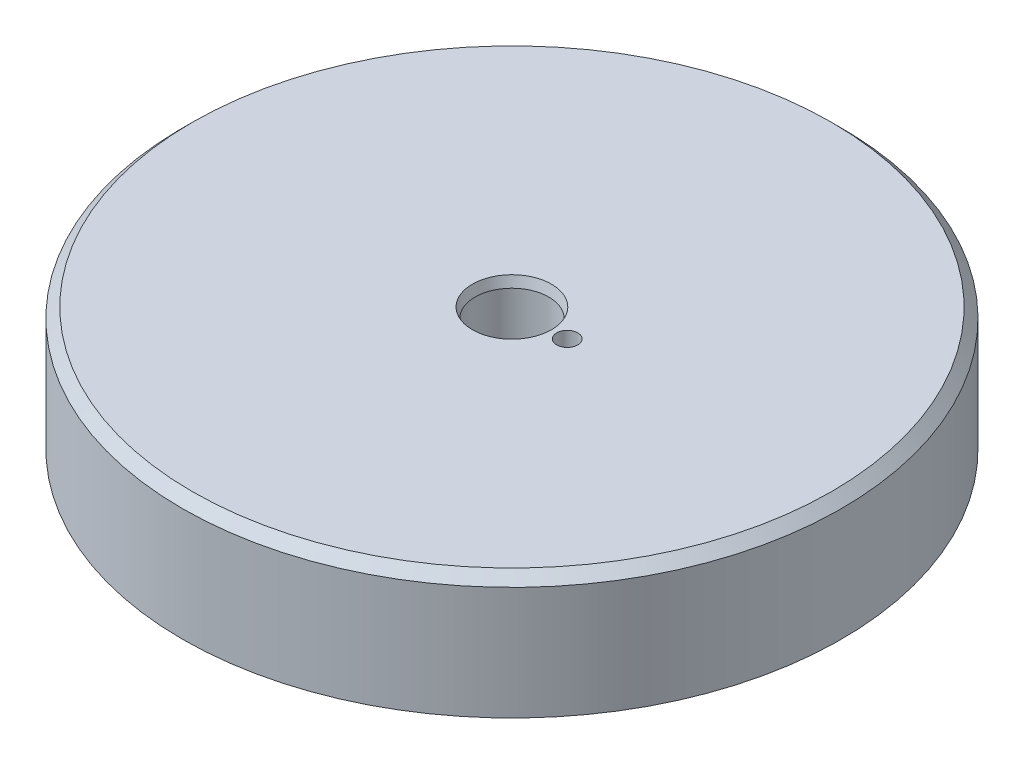
ISO-10303-21;
HEADER;
FILE_DESCRIPTION(('STEP AP214'),'2;1');
FILE_NAME('part.step','',(''),(''),'','','');
FILE_SCHEMA(('AUTOMOTIVE_DESIGN { 1 0 10303 214 1 1 1 1 }'));
ENDSEC;
DATA;
#1=APPLICATION_CONTEXT('core data for automotive mechanical design processes');
#2=APPLICATION_PROTOCOL_DEFINITION('international standard','automotive_design',2000,#1);
#3=PRODUCT_CONTEXT('',#1,'mechanical');
#4=PRODUCT('Part','Part','',(#3));
#5=PRODUCT_RELATED_PRODUCT_CATEGORY('part','',(#4));
#6=PRODUCT_DEFINITION_FORMATION('','',#4);
#7=PRODUCT_DEFINITION_CONTEXT('part definition',#1,'design');
#8=PRODUCT_DEFINITION('design','',#6,#7);
#9=PRODUCT_DEFINITION_SHAPE('','',#8);
#10=(LENGTH_UNIT() NAMED_UNIT(*) SI_UNIT(.MILLI.,.METRE.));
#11=(NAMED_UNIT(*) PLANE_ANGLE_UNIT() SI_UNIT($,.RADIAN.));
#12=(NAMED_UNIT(*) SI_UNIT($,.STERADIAN.) SOLID_ANGLE_UNIT());
#13=UNCERTAINTY_MEASURE_WITH_UNIT(LENGTH_MEASURE(1.E-05),#10,'distance_accuracy_value','');
#14=(GEOMETRIC_REPRESENTATION_CONTEXT(3) GLOBAL_UNCERTAINTY_ASSIGNED_CONTEXT((#13)) GLOBAL_UNIT_ASSIGNED_CONTEXT((#10,
#11,#12)) REPRESENTATION_CONTEXT('',''));
#15=CARTESIAN_POINT('',(0.,0.,0.));
#16=DIRECTION('',(0.,0.,1.));
#17=DIRECTION('',(1.,0.,0.));
#18=AXIS2_PLACEMENT_3D('',#15,#16,#17);
#19=CARTESIAN_POINT('',(0.,15.875,0.));
#20=DIRECTION('',(0.,-1.,0.));
#21=DIRECTION('',(0.,0.,-1.));
#22=AXIS2_PLACEMENT_3D('',#19,#20,#21);
#23=CYLINDRICAL_SURFACE('',#22,42.545);
#24=CARTESIAN_POINT('',(0.,14.605,0.));
#25=DIRECTION('',(0.,1.,0.));
#26=DIRECTION('',(0.,0.,1.));
#27=AXIS2_PLACEMENT_3D('',#24,#25,#26);
#28=CIRCLE('',#27,42.545);
#29=CARTESIAN_POINT('',(0.,14.605,42.545));
#30=VERTEX_POINT('',#29);
#31=EDGE_CURVE('E105',#30,#30,#28,.F.);
#32=ORIENTED_EDGE('',*,*,#31,.T.);
#33=EDGE_LOOP('',(#32));
#34=FACE_BOUND('',#33,.T.);
#35=CARTESIAN_POINT('',(0.,0.,0.));
#36=DIRECTION('',(0.,-1.,0.));
#37=DIRECTION('',(0.,0.,1.));
#38=AXIS2_PLACEMENT_3D('',#35,#36,#37);
#39=CIRCLE('',#38,42.545);
#40=CARTESIAN_POINT('',(0.,0.,42.545));
#41=VERTEX_POINT('',#40);
#42=EDGE_CURVE('E93',#41,#41,#39,.T.);
#43=ORIENTED_EDGE('',*,*,#42,.F.);
#44=EDGE_LOOP('',(#43));
#45=FACE_BOUND('',#44,.T.);
#46=ADVANCED_FACE('F51',(#34,#45),#23,.T.);
#47=CARTESIAN_POINT('',(0.,15.875,0.));
#48=DIRECTION('',(0.,1.,0.));
#49=DIRECTION('',(0.,0.,1.));
#50=AXIS2_PLACEMENT_3D('',#47,#48,#49);
#51=PLANE('',#50);
#52=CARTESIAN_POINT('',(0.,15.875,0.));
#53=DIRECTION('',(0.,1.,0.));
#54=DIRECTION('',(0.,0.,1.));
#55=AXIS2_PLACEMENT_3D('',#52,#53,#54);
#56=CIRCLE('',#55,41.275);
#57=CARTESIAN_POINT('',(0.,15.875,41.275));
#58=VERTEX_POINT('',#57);
#59=EDGE_CURVE('E109',#58,#58,#56,.T.);
#60=ORIENTED_EDGE('',*,*,#59,.T.);
#61=EDGE_LOOP('',(#60));
#62=FACE_BOUND('',#61,.T.);
#63=CARTESIAN_POINT('',(0.,15.875,0.));
#64=DIRECTION('',(0.,1.,0.));
#65=DIRECTION('',(0.,0.,1.));
#66=AXIS2_PLACEMENT_3D('',#63,#64,#65);
#67=CIRCLE('',#66,5.10279547438751);
#68=CARTESIAN_POINT('',(0.,15.875,5.10279547438751));
#69=VERTEX_POINT('',#68);
#70=EDGE_CURVE('E101',#69,#69,#67,.F.);
#71=ORIENTED_EDGE('',*,*,#70,.T.);
#72=EDGE_LOOP('',(#71));
#73=FACE_BOUND('',#72,.T.);
#74=CARTESIAN_POINT('',(7.1374,15.875,0.));
#75=DIRECTION('',(0.,1.,0.));
#76=DIRECTION('',(0.,0.,-1.));
#77=AXIS2_PLACEMENT_3D('',#74,#75,#76);
#78=CIRCLE('',#77,1.3589);
#79=CARTESIAN_POINT('',(7.1374,15.875,-1.3589));
#80=VERTEX_POINT('',#79);
#81=EDGE_CURVE('E381',#80,#80,#78,.T.);
#82=ORIENTED_EDGE('',*,*,#81,.F.);
#83=EDGE_LOOP('',(#82));
#84=FACE_BOUND('',#83,.T.);
#85=ADVANCED_FACE('F164',(#62,#73,#84),#51,.T.);
#86=CARTESIAN_POINT('',(0.,0.,0.));
#87=DIRECTION('',(0.,1.,0.));
#88=DIRECTION('',(0.,0.,1.));
#89=AXIS2_PLACEMENT_3D('',#86,#87,#88);
#90=PLANE('',#89);
#91=CARTESIAN_POINT('',(0.,0.,0.));
#92=DIRECTION('',(0.,1.,0.));
#93=DIRECTION('',(0.,0.,1.));
#94=AXIS2_PLACEMENT_3D('',#91,#92,#93);
#95=CIRCLE('',#94,39.5986);
#96=CARTESIAN_POINT('',(0.,0.,39.5986));
#97=VERTEX_POINT('',#96);
#98=EDGE_CURVE('E11',#97,#97,#95,.T.);
#99=ORIENTED_EDGE('',*,*,#98,.T.);
#100=EDGE_LOOP('',(#99));
#101=FACE_BOUND('',#100,.T.);
#102=ORIENTED_EDGE('',*,*,#42,.T.);
#103=EDGE_LOOP('',(#102));
#104=FACE_BOUND('',#103,.T.);
#105=ADVANCED_FACE('F161',(#101,#104),#90,.F.);
#106=CARTESIAN_POINT('',(0.,2.6416,0.));
#107=DIRECTION('',(0.,-1.,0.));
#108=DIRECTION('',(0.,0.,-1.));
#109=AXIS2_PLACEMENT_3D('',#106,#107,#108);
#110=CYLINDRICAL_SURFACE('',#109,39.3446);
#111=CARTESIAN_POINT('',(0.,2.3876,0.));
#112=DIRECTION('',(0.,1.,0.));
#113=DIRECTION('',(0.,0.,1.));
#114=AXIS2_PLACEMENT_3D('',#111,#112,#113);
#115=CIRCLE('',#114,39.3446);
#116=CARTESIAN_POINT('',(0.,2.3876,39.3446));
#117=VERTEX_POINT('',#116);
#118=EDGE_CURVE('E60',#117,#117,#115,.T.);
#119=ORIENTED_EDGE('',*,*,#118,.T.);
#120=EDGE_LOOP('',(#119));
#121=FACE_BOUND('',#120,.T.);
#122=CARTESIAN_POINT('',(0.,0.254,0.));
#123=DIRECTION('',(0.,1.,0.));
#124=DIRECTION('',(0.,0.,1.));
#125=AXIS2_PLACEMENT_3D('',#122,#123,#124);
#126=CIRCLE('',#125,39.3446);
#127=CARTESIAN_POINT('',(0.,0.254,39.3446));
#128=VERTEX_POINT('',#127);
#129=EDGE_CURVE('E133',#128,#128,#126,.F.);
#130=ORIENTED_EDGE('',*,*,#129,.T.);
#131=EDGE_LOOP('',(#130));
#132=FACE_BOUND('',#131,.T.);
#133=ADVANCED_FACE('F140',(#121,#132),#110,.F.);
#134=CARTESIAN_POINT('',(0.,2.6416,0.));
#135=DIRECTION('',(0.,1.,0.));
#136=DIRECTION('',(0.,0.,1.));
#137=AXIS2_PLACEMENT_3D('',#134,#135,#136);
#138=PLANE('',#137);
#139=CARTESIAN_POINT('',(0.,2.6416,0.));
#140=DIRECTION('',(0.,1.,0.));
#141=DIRECTION('',(0.,0.,1.));
#142=AXIS2_PLACEMENT_3D('',#139,#140,#141);
#143=CIRCLE('',#142,34.9758);
#144=CARTESIAN_POINT('',(0.,2.6416,34.9758));
#145=VERTEX_POINT('',#144);
#146=EDGE_CURVE('E129',#145,#145,#143,.T.);
#147=ORIENTED_EDGE('',*,*,#146,.T.);
#148=EDGE_LOOP('',(#147));
#149=FACE_BOUND('',#148,.T.);
#150=CARTESIAN_POINT('',(0.,2.6416,0.));
#151=DIRECTION('',(0.,1.,0.));
#152=DIRECTION('',(0.,0.,1.));
#153=AXIS2_PLACEMENT_3D('',#150,#151,#152);
#154=CIRCLE('',#153,39.0906);
#155=CARTESIAN_POINT('',(0.,2.6416,39.0906));
#156=VERTEX_POINT('',#155);
#157=EDGE_CURVE('E125',#156,#156,#154,.F.);
#158=ORIENTED_EDGE('',*,*,#157,.T.);
#159=EDGE_LOOP('',(#158));
#160=FACE_BOUND('',#159,.T.);
#161=ADVANCED_FACE('F149',(#149,#160),#138,.F.);
#162=CARTESIAN_POINT('',(0.,2.6416,0.));
#163=DIRECTION('',(0.,-1.,0.));
#164=DIRECTION('',(0.,0.,-1.));
#165=AXIS2_PLACEMENT_3D('',#162,#163,#164);
#166=CYLINDRICAL_SURFACE('',#165,34.7218);
#167=CARTESIAN_POINT('',(0.,0.254,0.));
#168=DIRECTION('',(0.,1.,0.));
#169=DIRECTION('',(0.,0.,1.));
#170=AXIS2_PLACEMENT_3D('',#167,#168,#169);
#171=CIRCLE('',#170,34.7218);
#172=CARTESIAN_POINT('',(0.,0.254,34.7218));
#173=VERTEX_POINT('',#172);
#174=EDGE_CURVE('E121',#173,#173,#171,.T.);
#175=ORIENTED_EDGE('',*,*,#174,.T.);
#176=EDGE_LOOP('',(#175));
#177=FACE_BOUND('',#176,.T.);
#178=CARTESIAN_POINT('',(0.,2.3876,0.));
#179=DIRECTION('',(0.,1.,0.));
#180=DIRECTION('',(0.,0.,1.));
#181=AXIS2_PLACEMENT_3D('',#178,#179,#180);
#182=CIRCLE('',#181,34.7218);
#183=CARTESIAN_POINT('',(0.,2.3876,34.7218));
#184=VERTEX_POINT('',#183);
#185=EDGE_CURVE('E117',#184,#184,#182,.F.);
#186=ORIENTED_EDGE('',*,*,#185,.T.);
#187=EDGE_LOOP('',(#186));
#188=FACE_BOUND('',#187,.T.);
#189=ADVANCED_FACE('F151',(#177,#188),#166,.T.);
#190=CARTESIAN_POINT('',(0.,0.,0.));
#191=DIRECTION('',(0.,1.,0.));
#192=DIRECTION('',(0.,0.,1.));
#193=AXIS2_PLACEMENT_3D('',#190,#191,#192);
#194=CIRCLE('',#193,34.4678);
#195=CARTESIAN_POINT('',(0.,0.,34.4678));
#196=VERTEX_POINT('',#195);
#197=EDGE_CURVE('E113',#196,#196,#194,.F.);
#198=ORIENTED_EDGE('',*,*,#197,.T.);
#199=EDGE_LOOP('',(#198));
#200=FACE_BOUND('',#199,.T.);
#201=CARTESIAN_POINT('',(0.,0.,0.));
#202=DIRECTION('',(0.,1.,0.));
#203=DIRECTION('',(0.,0.,-1.));
#204=AXIS2_PLACEMENT_3D('',#201,#202,#203);
#205=CIRCLE('',#204,4.7625);
#206=CARTESIAN_POINT('',(0.,0.,-4.7625));
#207=VERTEX_POINT('',#206);
#208=EDGE_CURVE('E86',#207,#207,#205,.T.);
#209=ORIENTED_EDGE('',*,*,#208,.T.);
#210=EDGE_LOOP('',(#209));
#211=FACE_BOUND('',#210,.T.);
#212=CARTESIAN_POINT('',(7.39575421380457,0.,-27.6013304862101));
#213=DIRECTION('',(0.,-1.,0.));
#214=DIRECTION('',(0.,0.,-1.));
#215=AXIS2_PLACEMENT_3D('',#212,#213,#214);
#216=CIRCLE('',#215,2.55269999999999);
#217=CARTESIAN_POINT('',(7.39575421380457,0.,-30.1540304862101));
#218=VERTEX_POINT('',#217);
#219=EDGE_CURVE('E78',#218,#218,#216,.T.);
#220=ORIENTED_EDGE('',*,*,#219,.F.);
#221=EDGE_LOOP('',(#220));
#222=FACE_BOUND('',#221,.T.);
#223=CARTESIAN_POINT('',(-7.39575421380455,0.,27.6013304862101));
#224=DIRECTION('',(0.,-1.,0.));
#225=DIRECTION('',(0.,0.,-1.));
#226=AXIS2_PLACEMENT_3D('',#223,#224,#225);
#227=CIRCLE('',#226,2.55269999999999);
#228=CARTESIAN_POINT('',(-7.39575421380455,0.,25.0486304862101));
#229=VERTEX_POINT('',#228);
#230=EDGE_CURVE('E77',#229,#229,#227,.T.);
#231=ORIENTED_EDGE('',*,*,#230,.F.);
#232=EDGE_LOOP('',(#231));
#233=FACE_BOUND('',#232,.T.);
#234=ADVANCED_FACE('F158',(#200,#211,#222,#233),#90,.F.);
#235=CARTESIAN_POINT('',(-7.39575421380455,7.87399999999999,27.6013304862101));
#236=DIRECTION('',(0.,-1.,0.));
#237=DIRECTION('',(0.,0.,-1.));
#238=AXIS2_PLACEMENT_3D('',#235,#236,#237);
#239=CONICAL_SURFACE('',#238,2.55269999999999,1.02974425867665);
#240=CARTESIAN_POINT('',(-7.39575421380456,9.40781690219164,27.6013304862101));
#241=VERTEX_POINT('',#240);
#242=VERTEX_LOOP('',#241);
#243=FACE_BOUND('',#242,.T.);
#244=CARTESIAN_POINT('',(-7.39575421380455,7.87399999999999,27.6013304862101));
#245=DIRECTION('',(0.,-1.,0.));
#246=DIRECTION('',(0.,0.,-1.));
#247=AXIS2_PLACEMENT_3D('',#244,#245,#246);
#248=CIRCLE('',#247,2.55269999999999);
#249=CARTESIAN_POINT('',(-7.39575421380455,7.87399999999999,25.0486304862101));
#250=VERTEX_POINT('',#249);
#251=EDGE_CURVE('E83',#250,#250,#248,.T.);
#252=ORIENTED_EDGE('',*,*,#251,.T.);
#253=EDGE_LOOP('',(#252));
#254=FACE_BOUND('',#253,.T.);
#255=ADVANCED_FACE('F281',(#243,#254),#239,.F.);
#256=CARTESIAN_POINT('',(-7.39575421380455,0.,27.6013304862101));
#257=DIRECTION('',(0.,-1.,0.));
#258=DIRECTION('',(0.,0.,-1.));
#259=AXIS2_PLACEMENT_3D('',#256,#257,#258);
#260=CYLINDRICAL_SURFACE('',#259,2.55269999999999);
#261=ORIENTED_EDGE('',*,*,#251,.F.);
#262=EDGE_LOOP('',(#261));
#263=FACE_BOUND('',#262,.T.);
#264=ORIENTED_EDGE('',*,*,#230,.T.);
#265=EDGE_LOOP('',(#264));
#266=FACE_BOUND('',#265,.T.);
#267=ADVANCED_FACE('F70',(#263,#266),#260,.F.);
#268=CARTESIAN_POINT('',(7.39575421380457,7.87399999999999,-27.6013304862101));
#269=DIRECTION('',(0.,-1.,0.));
#270=DIRECTION('',(0.,0.,-1.));
#271=AXIS2_PLACEMENT_3D('',#268,#269,#270);
#272=CONICAL_SURFACE('',#271,2.55269999999999,1.02974425867665);
#273=CARTESIAN_POINT('',(7.39575421380456,9.40781690219164,-27.6013304862101));
#274=VERTEX_POINT('',#273);
#275=VERTEX_LOOP('',#274);
#276=FACE_BOUND('',#275,.T.);
#277=CARTESIAN_POINT('',(7.39575421380457,7.87399999999999,-27.6013304862101));
#278=DIRECTION('',(0.,-1.,0.));
#279=DIRECTION('',(0.,0.,-1.));
#280=AXIS2_PLACEMENT_3D('',#277,#278,#279);
#281=CIRCLE('',#280,2.55269999999999);
#282=CARTESIAN_POINT('',(7.39575421380457,7.87399999999999,-30.1540304862101));
#283=VERTEX_POINT('',#282);
#284=EDGE_CURVE('E74',#283,#283,#281,.T.);
#285=ORIENTED_EDGE('',*,*,#284,.T.);
#286=EDGE_LOOP('',(#285));
#287=FACE_BOUND('',#286,.T.);
#288=ADVANCED_FACE('F66',(#276,#287),#272,.F.);
#289=CARTESIAN_POINT('',(7.39575421380457,0.,-27.6013304862101));
#290=DIRECTION('',(0.,-1.,0.));
#291=DIRECTION('',(0.,0.,-1.));
#292=AXIS2_PLACEMENT_3D('',#289,#290,#291);
#293=CYLINDRICAL_SURFACE('',#292,2.55269999999999);
#294=ORIENTED_EDGE('',*,*,#284,.F.);
#295=EDGE_LOOP('',(#294));
#296=FACE_BOUND('',#295,.T.);
#297=ORIENTED_EDGE('',*,*,#219,.T.);
#298=EDGE_LOOP('',(#297));
#299=FACE_BOUND('',#298,.T.);
#300=ADVANCED_FACE('F69',(#296,#299),#293,.F.);
#301=CARTESIAN_POINT('',(0.,0.,0.));
#302=DIRECTION('',(0.,1.,0.));
#303=DIRECTION('',(0.,0.,1.));
#304=AXIS2_PLACEMENT_3D('',#301,#302,#303);
#305=CYLINDRICAL_SURFACE('',#304,4.7625);
#306=CARTESIAN_POINT('',(0.,14.6050000000001,0.));
#307=DIRECTION('',(0.,1.,0.));
#308=DIRECTION('',(0.,0.,1.));
#309=AXIS2_PLACEMENT_3D('',#306,#307,#308);
#310=CIRCLE('',#309,4.7625);
#311=CARTESIAN_POINT('',(0.,14.6050000000001,4.7625));
#312=VERTEX_POINT('',#311);
#313=EDGE_CURVE('E97',#312,#312,#310,.T.);
#314=ORIENTED_EDGE('',*,*,#313,.T.);
#315=EDGE_LOOP('',(#314));
#316=FACE_BOUND('',#315,.T.);
#317=ORIENTED_EDGE('',*,*,#208,.F.);
#318=EDGE_LOOP('',(#317));
#319=FACE_BOUND('',#318,.T.);
#320=ADVANCED_FACE('F251',(#316,#319),#305,.F.);
#321=CARTESIAN_POINT('',(7.1374,12.573,0.));
#322=DIRECTION('',(0.,1.,0.));
#323=DIRECTION('',(0.,0.,1.));
#324=AXIS2_PLACEMENT_3D('',#321,#322,#323);
#325=CYLINDRICAL_SURFACE('',#324,1.3589);
#326=CARTESIAN_POINT('',(7.1374,12.573,0.));
#327=DIRECTION('',(0.,1.,0.));
#328=DIRECTION('',(0.,0.,-1.));
#329=AXIS2_PLACEMENT_3D('',#326,#327,#328);
#330=CIRCLE('',#329,1.3589);
#331=CARTESIAN_POINT('',(7.1374,12.573,-1.3589));
#332=VERTEX_POINT('',#331);
#333=EDGE_CURVE('E378',#332,#332,#330,.T.);
#334=ORIENTED_EDGE('',*,*,#333,.F.);
#335=EDGE_LOOP('',(#334));
#336=FACE_BOUND('',#335,.T.);
#337=ORIENTED_EDGE('',*,*,#81,.T.);
#338=EDGE_LOOP('',(#337));
#339=FACE_BOUND('',#338,.T.);
#340=ADVANCED_FACE('F242',(#336,#339),#325,.F.);
#341=CARTESIAN_POINT('',(7.1374,12.573,0.));
#342=DIRECTION('',(0.,-1.,0.));
#343=DIRECTION('',(0.,0.,-1.));
#344=AXIS2_PLACEMENT_3D('',#341,#342,#343);
#345=PLANE('',#344);
#346=ORIENTED_EDGE('',*,*,#333,.T.);
#347=EDGE_LOOP('',(#346));
#348=FACE_BOUND('',#347,.T.);
#349=ADVANCED_FACE('F183',(#348),#345,.F.);
#350=CARTESIAN_POINT('',(0.,14.6050000000001,0.));
#351=DIRECTION('',(0.,1.,0.));
#352=DIRECTION('',(0.,0.,1.));
#353=AXIS2_PLACEMENT_3D('',#350,#351,#352);
#354=CONICAL_SURFACE('',#353,4.7625,0.261799387799151);
#355=ORIENTED_EDGE('',*,*,#70,.F.);
#356=EDGE_LOOP('',(#355));
#357=FACE_BOUND('',#356,.T.);
#358=ORIENTED_EDGE('',*,*,#313,.F.);
#359=EDGE_LOOP('',(#358));
#360=FACE_BOUND('',#359,.T.);
#361=ADVANCED_FACE('F177',(#357,#360),#354,.F.);
#362=CARTESIAN_POINT('',(0.,14.605,0.));
#363=DIRECTION('',(0.,-1.,0.));
#364=DIRECTION('',(0.,0.,-1.));
#365=AXIS2_PLACEMENT_3D('',#362,#363,#364);
#366=CONICAL_SURFACE('',#365,42.545,0.785398163397448);
#367=ORIENTED_EDGE('',*,*,#59,.F.);
#368=EDGE_LOOP('',(#367));
#369=FACE_BOUND('',#368,.T.);
#370=ORIENTED_EDGE('',*,*,#31,.F.);
#371=EDGE_LOOP('',(#370));
#372=FACE_BOUND('',#371,.T.);
#373=ADVANCED_FACE('F182',(#369,#372),#366,.T.);
#374=CARTESIAN_POINT('',(0.,0.254,0.));
#375=DIRECTION('',(0.,1.,0.));
#376=DIRECTION('',(0.,0.,1.));
#377=AXIS2_PLACEMENT_3D('',#374,#375,#376);
#378=TOROIDAL_SURFACE('',#377,34.4678,0.254);
#379=ORIENTED_EDGE('',*,*,#174,.F.);
#380=EDGE_LOOP('',(#379));
#381=FACE_BOUND('',#380,.T.);
#382=ORIENTED_EDGE('',*,*,#197,.F.);
#383=EDGE_LOOP('',(#382));
#384=FACE_BOUND('',#383,.T.);
#385=ADVANCED_FACE('F189',(#381,#384),#378,.T.);
#386=CARTESIAN_POINT('',(0.,2.3876,0.));
#387=DIRECTION('',(0.,1.,0.));
#388=DIRECTION('',(0.,0.,1.));
#389=AXIS2_PLACEMENT_3D('',#386,#387,#388);
#390=TOROIDAL_SURFACE('',#389,34.9758,0.254);
#391=ORIENTED_EDGE('',*,*,#146,.F.);
#392=EDGE_LOOP('',(#391));
#393=FACE_BOUND('',#392,.T.);
#394=ORIENTED_EDGE('',*,*,#185,.F.);
#395=EDGE_LOOP('',(#394));
#396=FACE_BOUND('',#395,.T.);
#397=ADVANCED_FACE('F146',(#393,#396),#390,.F.);
#398=CARTESIAN_POINT('',(0.,2.3876,0.));
#399=DIRECTION('',(0.,1.,0.));
#400=DIRECTION('',(0.,0.,1.));
#401=AXIS2_PLACEMENT_3D('',#398,#399,#400);
#402=TOROIDAL_SURFACE('',#401,39.0906,0.254);
#403=ORIENTED_EDGE('',*,*,#118,.F.);
#404=EDGE_LOOP('',(#403));
#405=FACE_BOUND('',#404,.T.);
#406=ORIENTED_EDGE('',*,*,#157,.F.);
#407=EDGE_LOOP('',(#406));
#408=FACE_BOUND('',#407,.T.);
#409=ADVANCED_FACE('F143',(#405,#408),#402,.F.);
#410=CARTESIAN_POINT('',(0.,0.254,0.));
#411=DIRECTION('',(0.,1.,0.));
#412=DIRECTION('',(0.,0.,1.));
#413=AXIS2_PLACEMENT_3D('',#410,#411,#412);
#414=TOROIDAL_SURFACE('',#413,39.5986,0.254);
#415=ORIENTED_EDGE('',*,*,#98,.F.);
#416=EDGE_LOOP('',(#415));
#417=FACE_BOUND('',#416,.T.);
#418=ORIENTED_EDGE('',*,*,#129,.F.);
#419=EDGE_LOOP('',(#418));
#420=FACE_BOUND('',#419,.T.);
#421=ADVANCED_FACE('F53',(#417,#420),#414,.T.);
#422=CLOSED_SHELL('',(#46,#85,#105,#133,#161,#189,#234,#255,#267,#288,#300,#320,#340,#349,#361,
#373,#385,#397,#409,#421));
#423=MANIFOLD_SOLID_BREP('B2',#422);
#424=ADVANCED_BREP_SHAPE_REPRESENTATION('',(#18,#423),#14);
#425=SHAPE_DEFINITION_REPRESENTATION(#9,#424);
ENDSEC;
END-ISO-10303-21;
